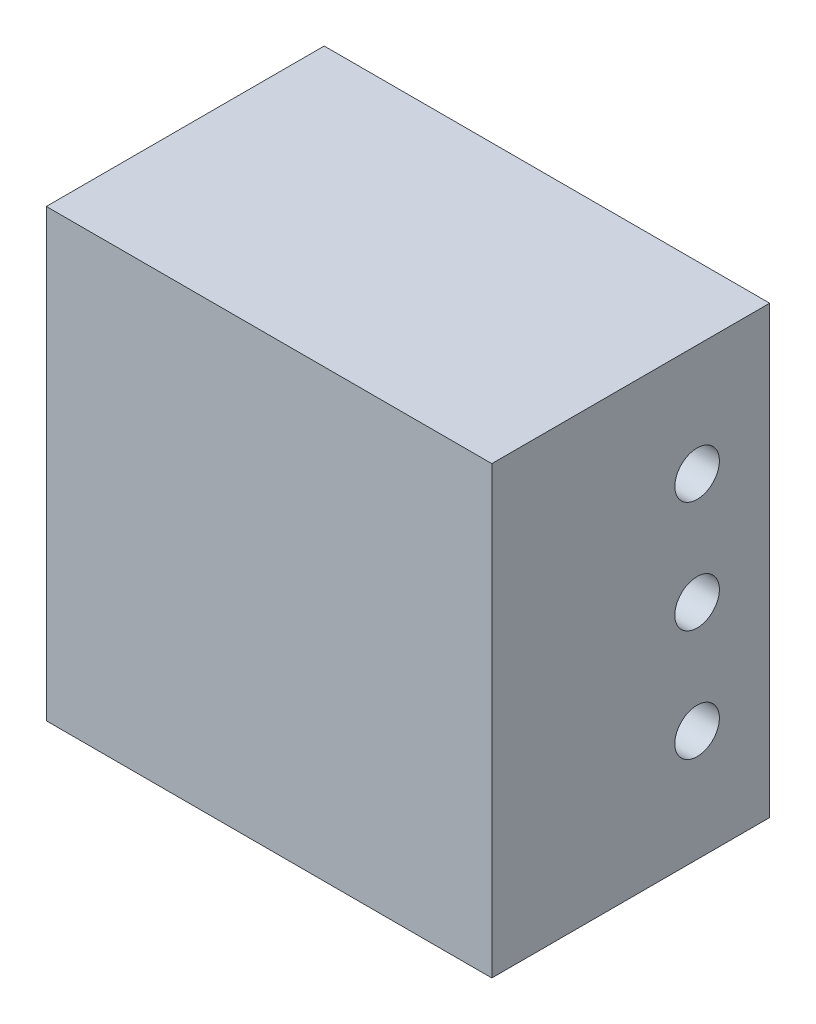
ISO-10303-21;
HEADER;
FILE_DESCRIPTION(('STEP AP214'),'2;1');
FILE_NAME('part.step','',(''),(''),'','','');
FILE_SCHEMA(('AUTOMOTIVE_DESIGN { 1 0 10303 214 1 1 1 1 }'));
ENDSEC;
DATA;
#1=APPLICATION_CONTEXT('core data for automotive mechanical design processes');
#2=APPLICATION_PROTOCOL_DEFINITION('international standard','automotive_design',2000,#1);
#3=PRODUCT_CONTEXT('',#1,'mechanical');
#4=PRODUCT('Part','Part','',(#3));
#5=PRODUCT_RELATED_PRODUCT_CATEGORY('part','',(#4));
#6=PRODUCT_DEFINITION_FORMATION('','',#4);
#7=PRODUCT_DEFINITION_CONTEXT('part definition',#1,'design');
#8=PRODUCT_DEFINITION('design','',#6,#7);
#9=PRODUCT_DEFINITION_SHAPE('','',#8);
#10=(LENGTH_UNIT() NAMED_UNIT(*) SI_UNIT(.MILLI.,.METRE.));
#11=(NAMED_UNIT(*) PLANE_ANGLE_UNIT() SI_UNIT($,.RADIAN.));
#12=(NAMED_UNIT(*) SI_UNIT($,.STERADIAN.) SOLID_ANGLE_UNIT());
#13=UNCERTAINTY_MEASURE_WITH_UNIT(LENGTH_MEASURE(1.E-05),#10,'distance_accuracy_value','');
#14=(GEOMETRIC_REPRESENTATION_CONTEXT(3) GLOBAL_UNCERTAINTY_ASSIGNED_CONTEXT((#13)) GLOBAL_UNIT_ASSIGNED_CONTEXT((#10,
#11,#12)) REPRESENTATION_CONTEXT('',''));
#15=CARTESIAN_POINT('',(0.,0.,0.));
#16=DIRECTION('',(0.,0.,1.));
#17=DIRECTION('',(1.,0.,0.));
#18=AXIS2_PLACEMENT_3D('',#15,#16,#17);
#19=CARTESIAN_POINT('',(127.,63.5,41.375));
#20=DIRECTION('',(0.,-1.,0.));
#21=DIRECTION('',(0.,0.,-1.));
#22=AXIS2_PLACEMENT_3D('',#19,#20,#21);
#23=PLANE('',#22);
#24=DIRECTION('',(1.,0.,0.));
#25=VECTOR('',#24,1.);
#26=CARTESIAN_POINT('',(0.,63.5,37.845));
#27=LINE('',#26,#25);
#28=CARTESIAN_POINT('',(0.,63.5,37.845));
#29=VERTEX_POINT('',#28);
#30=CARTESIAN_POINT('',(127.,63.5,37.845));
#31=VERTEX_POINT('',#30);
#32=EDGE_CURVE('E51',#29,#31,#27,.T.);
#33=ORIENTED_EDGE('',*,*,#32,.T.);
#34=DIRECTION('',(0.,0.,1.));
#35=VECTOR('',#34,1.);
#36=CARTESIAN_POINT('',(127.,63.5,41.375));
#37=LINE('',#36,#35);
#38=CARTESIAN_POINT('',(127.,63.5,-41.375));
#39=VERTEX_POINT('',#38);
#40=EDGE_CURVE('E99',#39,#31,#37,.T.);
#41=ORIENTED_EDGE('',*,*,#40,.F.);
#42=DIRECTION('',(-1.,0.,0.));
#43=VECTOR('',#42,1.);
#44=CARTESIAN_POINT('',(127.,63.5,-41.375));
#45=LINE('',#44,#43);
#46=CARTESIAN_POINT('',(0.,63.5,-41.375));
#47=VERTEX_POINT('',#46);
#48=EDGE_CURVE('E11',#39,#47,#45,.T.);
#49=ORIENTED_EDGE('',*,*,#48,.T.);
#50=DIRECTION('',(0.,0.,1.));
#51=VECTOR('',#50,1.);
#52=CARTESIAN_POINT('',(0.,63.5,41.375));
#53=LINE('',#52,#51);
#54=EDGE_CURVE('E83',#47,#29,#53,.T.);
#55=ORIENTED_EDGE('',*,*,#54,.T.);
#56=EDGE_LOOP('',(#33,#41,#49,#55));
#57=FACE_BOUND('',#56,.T.);
#58=ADVANCED_FACE('F36',(#57),#23,.F.);
#59=CARTESIAN_POINT('',(127.,-63.5,41.375));
#60=DIRECTION('',(0.,1.,0.));
#61=DIRECTION('',(0.,0.,1.));
#62=AXIS2_PLACEMENT_3D('',#59,#60,#61);
#63=PLANE('',#62);
#64=DIRECTION('',(1.,0.,0.));
#65=VECTOR('',#64,1.);
#66=CARTESIAN_POINT('',(127.,-63.5,37.845));
#67=LINE('',#66,#65);
#68=CARTESIAN_POINT('',(0.,-63.5,37.845));
#69=VERTEX_POINT('',#68);
#70=CARTESIAN_POINT('',(127.,-63.5,37.845));
#71=VERTEX_POINT('',#70);
#72=EDGE_CURVE('E79',#69,#71,#67,.T.);
#73=ORIENTED_EDGE('',*,*,#72,.F.);
#74=DIRECTION('',(0.,0.,-1.));
#75=VECTOR('',#74,1.);
#76=CARTESIAN_POINT('',(0.,-63.5,41.375));
#77=LINE('',#76,#75);
#78=CARTESIAN_POINT('',(0.,-63.5,-41.375));
#79=VERTEX_POINT('',#78);
#80=EDGE_CURVE('E74',#69,#79,#77,.T.);
#81=ORIENTED_EDGE('',*,*,#80,.T.);
#82=DIRECTION('',(-1.,0.,0.));
#83=VECTOR('',#82,1.);
#84=CARTESIAN_POINT('',(127.,-63.5,-41.375));
#85=LINE('',#84,#83);
#86=CARTESIAN_POINT('',(127.,-63.5,-41.375));
#87=VERTEX_POINT('',#86);
#88=EDGE_CURVE('E44',#87,#79,#85,.T.);
#89=ORIENTED_EDGE('',*,*,#88,.F.);
#90=DIRECTION('',(0.,0.,-1.));
#91=VECTOR('',#90,1.);
#92=CARTESIAN_POINT('',(127.,-63.5,41.375));
#93=LINE('',#92,#91);
#94=EDGE_CURVE('E60',#71,#87,#93,.T.);
#95=ORIENTED_EDGE('',*,*,#94,.F.);
#96=EDGE_LOOP('',(#73,#81,#89,#95));
#97=FACE_BOUND('',#96,.T.);
#98=ADVANCED_FACE('F76',(#97),#63,.F.);
#99=CARTESIAN_POINT('',(127.,0.,0.));
#100=DIRECTION('',(1.,0.,0.));
#101=DIRECTION('',(0.,0.,-1.));
#102=AXIS2_PLACEMENT_3D('',#99,#100,#101);
#103=PLANE('',#102);
#104=CARTESIAN_POINT('',(127.,-31.75,-20.6875));
#105=DIRECTION('',(1.,0.,0.));
#106=DIRECTION('',(0.,0.,-1.));
#107=AXIS2_PLACEMENT_3D('',#104,#105,#106);
#108=CIRCLE('',#107,6.35);
#109=CARTESIAN_POINT('',(127.,-31.75,-27.0375));
#110=VERTEX_POINT('',#109);
#111=EDGE_CURVE('E91',#110,#110,#108,.F.);
#112=ORIENTED_EDGE('',*,*,#111,.T.);
#113=EDGE_LOOP('',(#112));
#114=FACE_BOUND('',#113,.T.);
#115=CARTESIAN_POINT('',(127.,31.75,-20.6875));
#116=DIRECTION('',(1.,0.,0.));
#117=DIRECTION('',(0.,0.,-1.));
#118=AXIS2_PLACEMENT_3D('',#115,#116,#117);
#119=CIRCLE('',#118,6.35);
#120=CARTESIAN_POINT('',(127.,31.75,-27.0375));
#121=VERTEX_POINT('',#120);
#122=EDGE_CURVE('E95',#121,#121,#119,.F.);
#123=ORIENTED_EDGE('',*,*,#122,.T.);
#124=EDGE_LOOP('',(#123));
#125=FACE_BOUND('',#124,.T.);
#126=CARTESIAN_POINT('',(127.,0.,-20.6875));
#127=DIRECTION('',(1.,0.,0.));
#128=DIRECTION('',(0.,0.,-1.));
#129=AXIS2_PLACEMENT_3D('',#126,#127,#128);
#130=CIRCLE('',#129,6.35);
#131=CARTESIAN_POINT('',(127.,0.,-27.0375));
#132=VERTEX_POINT('',#131);
#133=EDGE_CURVE('E105',#132,#132,#130,.F.);
#134=ORIENTED_EDGE('',*,*,#133,.T.);
#135=EDGE_LOOP('',(#134));
#136=FACE_BOUND('',#135,.T.);
#137=ORIENTED_EDGE('',*,*,#40,.T.);
#138=DIRECTION('',(0.,-1.,0.));
#139=VECTOR('',#138,1.);
#140=CARTESIAN_POINT('',(127.,63.5,37.845));
#141=LINE('',#140,#139);
#142=EDGE_CURVE('E120',#31,#71,#141,.T.);
#143=ORIENTED_EDGE('',*,*,#142,.T.);
#144=ORIENTED_EDGE('',*,*,#94,.T.);
#145=DIRECTION('',(0.,1.,0.));
#146=VECTOR('',#145,1.);
#147=CARTESIAN_POINT('',(127.,63.5,-41.375));
#148=LINE('',#147,#146);
#149=EDGE_CURVE('E82',#87,#39,#148,.T.);
#150=ORIENTED_EDGE('',*,*,#149,.T.);
#151=EDGE_LOOP('',(#137,#143,#144,#150));
#152=FACE_BOUND('',#151,.T.);
#153=ADVANCED_FACE('F126',(#114,#125,#136,#152),#103,.T.);
#154=CARTESIAN_POINT('',(0.,0.,0.));
#155=DIRECTION('',(1.,0.,0.));
#156=DIRECTION('',(0.,0.,-1.));
#157=AXIS2_PLACEMENT_3D('',#154,#155,#156);
#158=PLANE('',#157);
#159=CARTESIAN_POINT('',(0.,0.,-20.6875));
#160=DIRECTION('',(1.,0.,0.));
#161=DIRECTION('',(0.,0.,-1.));
#162=AXIS2_PLACEMENT_3D('',#159,#160,#161);
#163=CIRCLE('',#162,6.35);
#164=CARTESIAN_POINT('',(0.,0.,-27.0375));
#165=VERTEX_POINT('',#164);
#166=EDGE_CURVE('E108',#165,#165,#163,.T.);
#167=ORIENTED_EDGE('',*,*,#166,.T.);
#168=EDGE_LOOP('',(#167));
#169=FACE_BOUND('',#168,.T.);
#170=CARTESIAN_POINT('',(0.,31.75,-20.6875));
#171=DIRECTION('',(1.,0.,0.));
#172=DIRECTION('',(0.,0.,-1.));
#173=AXIS2_PLACEMENT_3D('',#170,#171,#172);
#174=CIRCLE('',#173,6.35);
#175=CARTESIAN_POINT('',(0.,31.75,-27.0375));
#176=VERTEX_POINT('',#175);
#177=EDGE_CURVE('E111',#176,#176,#174,.T.);
#178=ORIENTED_EDGE('',*,*,#177,.T.);
#179=EDGE_LOOP('',(#178));
#180=FACE_BOUND('',#179,.T.);
#181=CARTESIAN_POINT('',(0.,-31.75,-20.6875));
#182=DIRECTION('',(1.,0.,0.));
#183=DIRECTION('',(0.,0.,-1.));
#184=AXIS2_PLACEMENT_3D('',#181,#182,#183);
#185=CIRCLE('',#184,6.35);
#186=CARTESIAN_POINT('',(0.,-31.75,-27.0375));
#187=VERTEX_POINT('',#186);
#188=EDGE_CURVE('E112',#187,#187,#185,.T.);
#189=ORIENTED_EDGE('',*,*,#188,.T.);
#190=EDGE_LOOP('',(#189));
#191=FACE_BOUND('',#190,.T.);
#192=DIRECTION('',(0.,-1.,0.));
#193=VECTOR('',#192,1.);
#194=CARTESIAN_POINT('',(0.,63.5,37.845));
#195=LINE('',#194,#193);
#196=EDGE_CURVE('E119',#29,#69,#195,.T.);
#197=ORIENTED_EDGE('',*,*,#196,.F.);
#198=ORIENTED_EDGE('',*,*,#54,.F.);
#199=DIRECTION('',(0.,1.,0.));
#200=VECTOR('',#199,1.);
#201=CARTESIAN_POINT('',(0.,63.5,-41.375));
#202=LINE('',#201,#200);
#203=EDGE_CURVE('E88',#79,#47,#202,.T.);
#204=ORIENTED_EDGE('',*,*,#203,.F.);
#205=ORIENTED_EDGE('',*,*,#80,.F.);
#206=EDGE_LOOP('',(#197,#198,#204,#205));
#207=FACE_BOUND('',#206,.T.);
#208=ADVANCED_FACE('F89',(#169,#180,#191,#207),#158,.F.);
#209=CARTESIAN_POINT('',(127.,63.5,-41.375));
#210=DIRECTION('',(0.,0.,1.));
#211=DIRECTION('',(0.,-1.,0.));
#212=AXIS2_PLACEMENT_3D('',#209,#210,#211);
#213=PLANE('',#212);
#214=ORIENTED_EDGE('',*,*,#203,.T.);
#215=ORIENTED_EDGE('',*,*,#48,.F.);
#216=ORIENTED_EDGE('',*,*,#149,.F.);
#217=ORIENTED_EDGE('',*,*,#88,.T.);
#218=EDGE_LOOP('',(#214,#215,#216,#217));
#219=FACE_BOUND('',#218,.T.);
#220=ADVANCED_FACE('F38',(#219),#213,.F.);
#221=CARTESIAN_POINT('',(127.000012,0.,-20.6875));
#222=DIRECTION('',(-1.,0.,0.));
#223=DIRECTION('',(0.,0.,1.));
#224=AXIS2_PLACEMENT_3D('',#221,#222,#223);
#225=CYLINDRICAL_SURFACE('',#224,6.35);
#226=ORIENTED_EDGE('',*,*,#133,.F.);
#227=EDGE_LOOP('',(#226));
#228=FACE_BOUND('',#227,.T.);
#229=ORIENTED_EDGE('',*,*,#166,.F.);
#230=EDGE_LOOP('',(#229));
#231=FACE_BOUND('',#230,.T.);
#232=ADVANCED_FACE('F182',(#228,#231),#225,.F.);
#233=CARTESIAN_POINT('',(127.000012,31.75,-20.6875));
#234=DIRECTION('',(-1.,0.,0.));
#235=DIRECTION('',(0.,0.,1.));
#236=AXIS2_PLACEMENT_3D('',#233,#234,#235);
#237=CYLINDRICAL_SURFACE('',#236,6.35);
#238=ORIENTED_EDGE('',*,*,#122,.F.);
#239=EDGE_LOOP('',(#238));
#240=FACE_BOUND('',#239,.T.);
#241=ORIENTED_EDGE('',*,*,#177,.F.);
#242=EDGE_LOOP('',(#241));
#243=FACE_BOUND('',#242,.T.);
#244=ADVANCED_FACE('F175',(#240,#243),#237,.F.);
#245=CARTESIAN_POINT('',(127.000012,-31.75,-20.6875));
#246=DIRECTION('',(-1.,0.,0.));
#247=DIRECTION('',(0.,0.,1.));
#248=AXIS2_PLACEMENT_3D('',#245,#246,#247);
#249=CYLINDRICAL_SURFACE('',#248,6.35);
#250=ORIENTED_EDGE('',*,*,#111,.F.);
#251=EDGE_LOOP('',(#250));
#252=FACE_BOUND('',#251,.T.);
#253=ORIENTED_EDGE('',*,*,#188,.F.);
#254=EDGE_LOOP('',(#253));
#255=FACE_BOUND('',#254,.T.);
#256=ADVANCED_FACE('F167',(#252,#255),#249,.F.);
#257=CARTESIAN_POINT('',(0.,63.5,37.845));
#258=DIRECTION('',(0.,0.,1.));
#259=DIRECTION('',(0.,-1.,0.));
#260=AXIS2_PLACEMENT_3D('',#257,#258,#259);
#261=PLANE('',#260);
#262=ORIENTED_EDGE('',*,*,#72,.T.);
#263=ORIENTED_EDGE('',*,*,#142,.F.);
#264=ORIENTED_EDGE('',*,*,#32,.F.);
#265=ORIENTED_EDGE('',*,*,#196,.T.);
#266=EDGE_LOOP('',(#262,#263,#264,#265));
#267=FACE_BOUND('',#266,.T.);
#268=ADVANCED_FACE('F122',(#267),#261,.T.);
#269=CLOSED_SHELL('',(#58,#98,#153,#208,#220,#232,#244,#256,#268));
#270=MANIFOLD_SOLID_BREP('B2',#269);
#271=ADVANCED_BREP_SHAPE_REPRESENTATION('',(#18,#270),#14);
#272=SHAPE_DEFINITION_REPRESENTATION(#9,#271);
ENDSEC;
END-ISO-10303-21;
